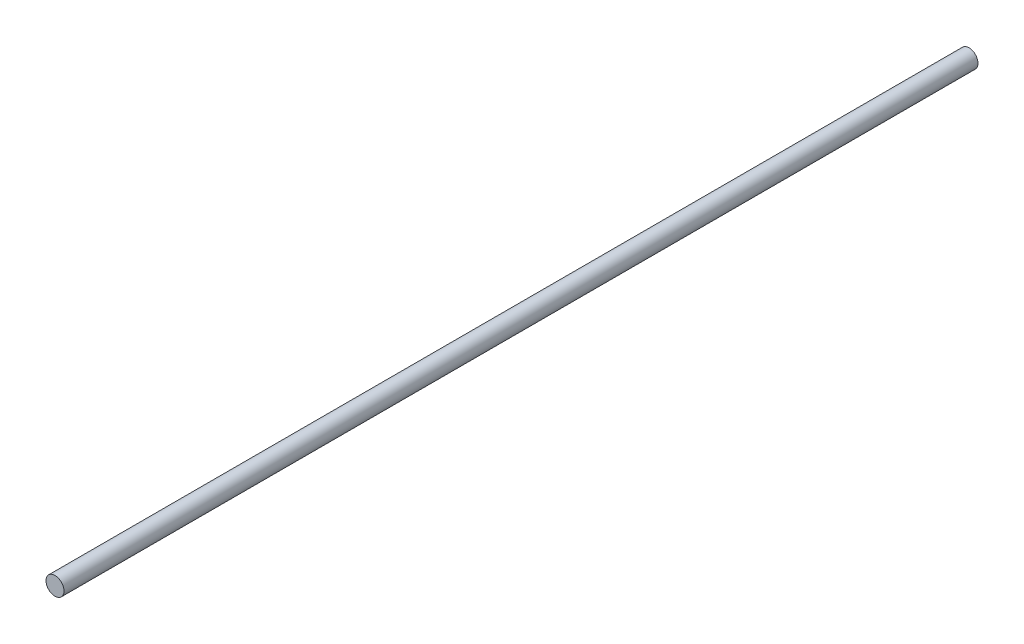
ISO-10303-21;
HEADER;
FILE_DESCRIPTION(('STEP AP214'),'2;1');
FILE_NAME('part.step','',(''),(''),'','','');
FILE_SCHEMA(('AUTOMOTIVE_DESIGN { 1 0 10303 214 1 1 1 1 }'));
ENDSEC;
DATA;
#1=APPLICATION_CONTEXT('core data for automotive mechanical design processes');
#2=APPLICATION_PROTOCOL_DEFINITION('international standard','automotive_design',2000,#1);
#3=PRODUCT_CONTEXT('',#1,'mechanical');
#4=PRODUCT('Part','Part','',(#3));
#5=PRODUCT_RELATED_PRODUCT_CATEGORY('part','',(#4));
#6=PRODUCT_DEFINITION_FORMATION('','',#4);
#7=PRODUCT_DEFINITION_CONTEXT('part definition',#1,'design');
#8=PRODUCT_DEFINITION('design','',#6,#7);
#9=PRODUCT_DEFINITION_SHAPE('','',#8);
#10=(LENGTH_UNIT() NAMED_UNIT(*) SI_UNIT(.MILLI.,.METRE.));
#11=(NAMED_UNIT(*) PLANE_ANGLE_UNIT() SI_UNIT($,.RADIAN.));
#12=(NAMED_UNIT(*) SI_UNIT($,.STERADIAN.) SOLID_ANGLE_UNIT());
#13=UNCERTAINTY_MEASURE_WITH_UNIT(LENGTH_MEASURE(1.E-05),#10,'distance_accuracy_value','');
#14=(GEOMETRIC_REPRESENTATION_CONTEXT(3) GLOBAL_UNCERTAINTY_ASSIGNED_CONTEXT((#13)) GLOBAL_UNIT_ASSIGNED_CONTEXT((#10,
#11,#12)) REPRESENTATION_CONTEXT('',''));
#15=CARTESIAN_POINT('',(0.,0.,0.));
#16=DIRECTION('',(0.,0.,1.));
#17=DIRECTION('',(1.,0.,0.));
#18=AXIS2_PLACEMENT_3D('',#15,#16,#17);
#19=CARTESIAN_POINT('',(0.,0.,406.));
#20=DIRECTION('',(0.,0.,-1.));
#21=DIRECTION('',(-1.,0.,0.));
#22=AXIS2_PLACEMENT_3D('',#19,#20,#21);
#23=CYLINDRICAL_SURFACE('',#22,4.);
#24=CARTESIAN_POINT('',(0.,0.,406.));
#25=DIRECTION('',(0.,0.,1.));
#26=DIRECTION('',(1.,0.,0.));
#27=AXIS2_PLACEMENT_3D('',#24,#25,#26);
#28=CIRCLE('',#27,4.);
#29=CARTESIAN_POINT('',(4.,0.,406.));
#30=VERTEX_POINT('',#29);
#31=EDGE_CURVE('E10',#30,#30,#28,.T.);
#32=ORIENTED_EDGE('',*,*,#31,.F.);
#33=EDGE_LOOP('',(#32));
#34=FACE_BOUND('',#33,.T.);
#35=CARTESIAN_POINT('',(0.,0.,0.));
#36=DIRECTION('',(0.,0.,1.));
#37=DIRECTION('',(1.,0.,0.));
#38=AXIS2_PLACEMENT_3D('',#35,#36,#37);
#39=CIRCLE('',#38,4.);
#40=CARTESIAN_POINT('',(4.,0.,0.));
#41=VERTEX_POINT('',#40);
#42=EDGE_CURVE('E39',#41,#41,#39,.T.);
#43=ORIENTED_EDGE('',*,*,#42,.T.);
#44=EDGE_LOOP('',(#43));
#45=FACE_BOUND('',#44,.T.);
#46=ADVANCED_FACE('F36',(#34,#45),#23,.T.);
#47=CARTESIAN_POINT('',(0.,0.,406.));
#48=DIRECTION('',(0.,0.,1.));
#49=DIRECTION('',(1.,0.,0.));
#50=AXIS2_PLACEMENT_3D('',#47,#48,#49);
#51=PLANE('',#50);
#52=ORIENTED_EDGE('',*,*,#31,.T.);
#53=EDGE_LOOP('',(#52));
#54=FACE_BOUND('',#53,.T.);
#55=ADVANCED_FACE('F52',(#54),#51,.T.);
#56=CARTESIAN_POINT('',(0.,0.,0.));
#57=DIRECTION('',(0.,0.,1.));
#58=DIRECTION('',(1.,0.,0.));
#59=AXIS2_PLACEMENT_3D('',#56,#57,#58);
#60=PLANE('',#59);
#61=ORIENTED_EDGE('',*,*,#42,.F.);
#62=EDGE_LOOP('',(#61));
#63=FACE_BOUND('',#62,.T.);
#64=ADVANCED_FACE('F50',(#63),#60,.F.);
#65=CLOSED_SHELL('',(#46,#55,#64));
#66=MANIFOLD_SOLID_BREP('B2',#65);
#67=ADVANCED_BREP_SHAPE_REPRESENTATION('',(#18,#66),#14);
#68=SHAPE_DEFINITION_REPRESENTATION(#9,#67);
ENDSEC;
END-ISO-10303-21;
